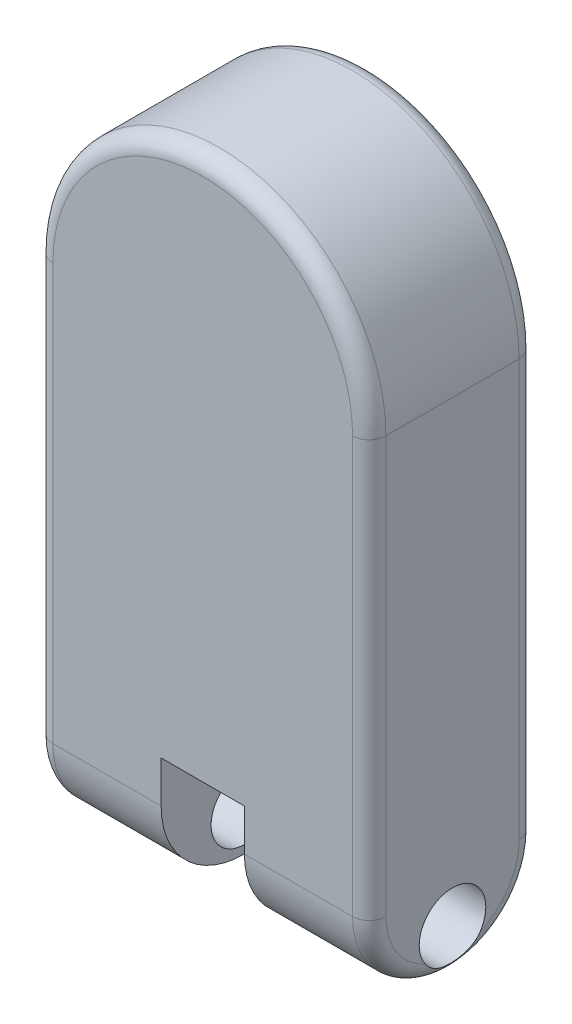
ISO-10303-21;
HEADER;
FILE_DESCRIPTION(('STEP AP214'),'2;1');
FILE_NAME('part.step','',(''),(''),'','','');
FILE_SCHEMA(('AUTOMOTIVE_DESIGN { 1 0 10303 214 1 1 1 1 }'));
ENDSEC;
DATA;
#1=APPLICATION_CONTEXT('core data for automotive mechanical design processes');
#2=APPLICATION_PROTOCOL_DEFINITION('international standard','automotive_design',2000,#1);
#3=PRODUCT_CONTEXT('',#1,'mechanical');
#4=PRODUCT('Part','Part','',(#3));
#5=PRODUCT_RELATED_PRODUCT_CATEGORY('part','',(#4));
#6=PRODUCT_DEFINITION_FORMATION('','',#4);
#7=PRODUCT_DEFINITION_CONTEXT('part definition',#1,'design');
#8=PRODUCT_DEFINITION('design','',#6,#7);
#9=PRODUCT_DEFINITION_SHAPE('','',#8);
#10=(LENGTH_UNIT() NAMED_UNIT(*) SI_UNIT(.MILLI.,.METRE.));
#11=(NAMED_UNIT(*) PLANE_ANGLE_UNIT() SI_UNIT($,.RADIAN.));
#12=(NAMED_UNIT(*) SI_UNIT($,.STERADIAN.) SOLID_ANGLE_UNIT());
#13=UNCERTAINTY_MEASURE_WITH_UNIT(LENGTH_MEASURE(1.E-05),#10,'distance_accuracy_value','');
#14=(GEOMETRIC_REPRESENTATION_CONTEXT(3) GLOBAL_UNCERTAINTY_ASSIGNED_CONTEXT((#13)) GLOBAL_UNIT_ASSIGNED_CONTEXT((#10,
#11,#12)) REPRESENTATION_CONTEXT('',''));
#15=CARTESIAN_POINT('',(0.,0.,0.));
#16=DIRECTION('',(0.,0.,1.));
#17=DIRECTION('',(1.,0.,0.));
#18=AXIS2_PLACEMENT_3D('',#15,#16,#17);
#19=CARTESIAN_POINT('',(-25.,-100.,-100.1));
#20=DIRECTION('',(0.,-1.,0.));
#21=DIRECTION('',(1.,0.,0.));
#22=AXIS2_PLACEMENT_3D('',#19,#20,#21);
#23=PLANE('',#22);
#24=DIRECTION('',(1.,0.,0.));
#25=VECTOR('',#24,1.);
#26=CARTESIAN_POINT('',(-25.,-100.,-100.));
#27=LINE('',#26,#25);
#28=CARTESIAN_POINT('',(-25.,-100.,-100.));
#29=VERTEX_POINT('',#28);
#30=CARTESIAN_POINT('',(25.,-100.,-100.));
#31=VERTEX_POINT('',#30);
#32=EDGE_CURVE('E92',#29,#31,#27,.T.);
#33=ORIENTED_EDGE('',*,*,#32,.T.);
#34=CARTESIAN_POINT('',(23.5893264020334,-100.,-90.1));
#35=DIRECTION('',(0.,-1.,0.));
#36=DIRECTION('',(1.,0.,0.));
#37=AXIS2_PLACEMENT_3D('',#34,#35,#36);
#38=CIRCLE('',#37,10.);
#39=CARTESIAN_POINT('',(23.5893264020334,-100.,-100.1));
#40=VERTEX_POINT('',#39);
#41=EDGE_CURVE('E12',#31,#40,#38,.F.);
#42=ORIENTED_EDGE('',*,*,#41,.T.);
#43=DIRECTION('',(1.,0.,0.));
#44=VECTOR('',#43,1.);
#45=CARTESIAN_POINT('',(-25.,-100.,-100.1));
#46=LINE('',#45,#44);
#47=CARTESIAN_POINT('',(-23.5893264020334,-100.,-100.1));
#48=VERTEX_POINT('',#47);
#49=EDGE_CURVE('E116',#48,#40,#46,.T.);
#50=ORIENTED_EDGE('',*,*,#49,.F.);
#51=CARTESIAN_POINT('',(-23.5893264020334,-100.,-90.1));
#52=DIRECTION('',(0.,-1.,0.));
#53=DIRECTION('',(1.,0.,0.));
#54=AXIS2_PLACEMENT_3D('',#51,#52,#53);
#55=CIRCLE('',#54,10.);
#56=EDGE_CURVE('E55',#48,#29,#55,.F.);
#57=ORIENTED_EDGE('',*,*,#56,.T.);
#58=EDGE_LOOP('',(#33,#42,#50,#57));
#59=FACE_BOUND('',#58,.T.);
#60=ADVANCED_FACE('F46',(#59),#23,.F.);
#61=CARTESIAN_POINT('',(0.,0.,-100.1));
#62=DIRECTION('',(0.,0.,-1.));
#63=DIRECTION('',(-1.,0.,0.));
#64=AXIS2_PLACEMENT_3D('',#61,#62,#63);
#65=PLANE('',#64);
#66=ORIENTED_EDGE('',*,*,#49,.T.);
#67=DIRECTION('',(0.,1.,0.));
#68=VECTOR('',#67,1.);
#69=CARTESIAN_POINT('',(23.5893264020334,-130.,-100.1));
#70=LINE('',#69,#68);
#71=CARTESIAN_POINT('',(23.5893264020334,-128.589326402033,-100.1));
#72=VERTEX_POINT('',#71);
#73=EDGE_CURVE('E104',#40,#72,#70,.F.);
#74=ORIENTED_EDGE('',*,*,#73,.T.);
#75=DIRECTION('',(1.,0.,0.));
#76=VECTOR('',#75,1.);
#77=CARTESIAN_POINT('',(-25.,-128.589326402033,-100.1));
#78=LINE('',#77,#76);
#79=CARTESIAN_POINT('',(-23.5893264020334,-128.589326402033,-100.1));
#80=VERTEX_POINT('',#79);
#81=EDGE_CURVE('E70',#72,#80,#78,.F.);
#82=ORIENTED_EDGE('',*,*,#81,.T.);
#83=DIRECTION('',(0.,-1.,0.));
#84=VECTOR('',#83,1.);
#85=CARTESIAN_POINT('',(-23.5893264020334,-100.,-100.1));
#86=LINE('',#85,#84);
#87=EDGE_CURVE('E107',#80,#48,#86,.F.);
#88=ORIENTED_EDGE('',*,*,#87,.T.);
#89=EDGE_LOOP('',(#66,#74,#82,#88));
#90=FACE_BOUND('',#89,.T.);
#91=ADVANCED_FACE('F120',(#90),#65,.T.);
#92=CARTESIAN_POINT('',(0.,0.,-100.));
#93=DIRECTION('',(0.,0.,-1.));
#94=DIRECTION('',(-1.,0.,0.));
#95=AXIS2_PLACEMENT_3D('',#92,#93,#94);
#96=PLANE('',#95);
#97=ORIENTED_EDGE('',*,*,#32,.F.);
#98=DIRECTION('',(0.,1.,0.));
#99=VECTOR('',#98,1.);
#100=CARTESIAN_POINT('',(-25.,-130.,-100.));
#101=LINE('',#100,#99);
#102=CARTESIAN_POINT('',(-25.,-130.,-100.));
#103=VERTEX_POINT('',#102);
#104=EDGE_CURVE('E115',#103,#29,#101,.T.);
#105=ORIENTED_EDGE('',*,*,#104,.F.);
#106=DIRECTION('',(-1.,0.,0.));
#107=VECTOR('',#106,1.);
#108=CARTESIAN_POINT('',(25.,-130.,-100.));
#109=LINE('',#108,#107);
#110=CARTESIAN_POINT('',(25.,-130.,-100.));
#111=VERTEX_POINT('',#110);
#112=EDGE_CURVE('E95',#111,#103,#109,.T.);
#113=ORIENTED_EDGE('',*,*,#112,.F.);
#114=DIRECTION('',(0.,-1.,0.));
#115=VECTOR('',#114,1.);
#116=CARTESIAN_POINT('',(25.,-100.,-100.));
#117=LINE('',#116,#115);
#118=EDGE_CURVE('E89',#31,#111,#117,.T.);
#119=ORIENTED_EDGE('',*,*,#118,.F.);
#120=EDGE_LOOP('',(#97,#105,#113,#119));
#121=FACE_BOUND('',#120,.T.);
#122=ADVANCED_FACE('F91',(#121),#96,.F.);
#123=CARTESIAN_POINT('',(-23.5893264020334,-130.,-90.1));
#124=DIRECTION('',(0.,1.,0.));
#125=DIRECTION('',(0.,0.,1.));
#126=AXIS2_PLACEMENT_3D('',#123,#124,#125);
#127=CYLINDRICAL_SURFACE('',#126,10.);
#128=ORIENTED_EDGE('',*,*,#56,.F.);
#129=ORIENTED_EDGE('',*,*,#87,.F.);
#130=CARTESIAN_POINT('',(-23.5893264020334,-128.589326402033,-90.1));
#131=DIRECTION('',(-0.707106781186547,0.707106781186547,0.));
#132=DIRECTION('',(0.707106781186547,0.707106781186547,0.));
#133=AXIS2_PLACEMENT_3D('',#130,#131,#132);
#134=ELLIPSE('',#133,14.1421356237309,10.);
#135=EDGE_CURVE('E50',#103,#80,#134,.F.);
#136=ORIENTED_EDGE('',*,*,#135,.F.);
#137=ORIENTED_EDGE('',*,*,#104,.T.);
#138=EDGE_LOOP('',(#128,#129,#136,#137));
#139=FACE_BOUND('',#138,.T.);
#140=ADVANCED_FACE('F48',(#139),#127,.T.);
#141=CARTESIAN_POINT('',(25.,-128.589326402033,-90.1));
#142=DIRECTION('',(-1.,0.,0.));
#143=DIRECTION('',(0.,0.,1.));
#144=AXIS2_PLACEMENT_3D('',#141,#142,#143);
#145=CYLINDRICAL_SURFACE('',#144,10.);
#146=ORIENTED_EDGE('',*,*,#135,.T.);
#147=ORIENTED_EDGE('',*,*,#81,.F.);
#148=CARTESIAN_POINT('',(23.5893264020334,-128.589326402033,-90.1));
#149=DIRECTION('',(-0.707106781186547,-0.707106781186548,0.));
#150=DIRECTION('',(-0.707106781186548,0.707106781186547,0.));
#151=AXIS2_PLACEMENT_3D('',#148,#149,#150);
#152=ELLIPSE('',#151,14.142135623731,10.);
#153=EDGE_CURVE('E63',#111,#72,#152,.F.);
#154=ORIENTED_EDGE('',*,*,#153,.F.);
#155=ORIENTED_EDGE('',*,*,#112,.T.);
#156=EDGE_LOOP('',(#146,#147,#154,#155));
#157=FACE_BOUND('',#156,.T.);
#158=ADVANCED_FACE('F113',(#157),#145,.T.);
#159=CARTESIAN_POINT('',(23.5893264020334,-100.,-90.1));
#160=DIRECTION('',(0.,-1.,0.));
#161=DIRECTION('',(1.,0.,0.));
#162=AXIS2_PLACEMENT_3D('',#159,#160,#161);
#163=CYLINDRICAL_SURFACE('',#162,10.);
#164=ORIENTED_EDGE('',*,*,#41,.F.);
#165=ORIENTED_EDGE('',*,*,#118,.T.);
#166=ORIENTED_EDGE('',*,*,#153,.T.);
#167=ORIENTED_EDGE('',*,*,#73,.F.);
#168=EDGE_LOOP('',(#164,#165,#166,#167));
#169=FACE_BOUND('',#168,.T.);
#170=ADVANCED_FACE('F103',(#169),#163,.T.);
#171=CLOSED_SHELL('',(#60,#91,#122,#140,#158,#170));
#172=MANIFOLD_SOLID_BREP('B2',#171);
#173=CARTESIAN_POINT('',(0.,-100.,-50.));
#174=DIRECTION('',(1.,0.,0.));
#175=DIRECTION('',(0.,0.,-1.));
#176=AXIS2_PLACEMENT_3D('',#173,#174,#175);
#177=CYLINDRICAL_SURFACE('',#176,50.);
#178=DIRECTION('',(1.,0.,0.));
#179=VECTOR('',#178,1.);
#180=CARTESIAN_POINT('',(0.,-100.,0.));
#181=LINE('',#180,#179);
#182=CARTESIAN_POINT('',(-90.,-100.,0.));
#183=VERTEX_POINT('',#182);
#184=CARTESIAN_POINT('',(-25.,-100.,0.));
#185=VERTEX_POINT('',#184);
#186=EDGE_CURVE('E367',#183,#185,#181,.T.);
#187=ORIENTED_EDGE('',*,*,#186,.F.);
#188=CARTESIAN_POINT('',(-90.,-100.,-50.));
#189=DIRECTION('',(-1.,0.,0.));
#190=DIRECTION('',(0.,-1.,0.));
#191=AXIS2_PLACEMENT_3D('',#188,#189,#190);
#192=CIRCLE('',#191,50.);
#193=CARTESIAN_POINT('',(-90.,-150.,-50.));
#194=VERTEX_POINT('',#193);
#195=EDGE_CURVE('E191',#183,#194,#192,.F.);
#196=ORIENTED_EDGE('',*,*,#195,.T.);
#197=DIRECTION('',(1.,0.,0.));
#198=VECTOR('',#197,1.);
#199=CARTESIAN_POINT('',(-100.,-150.,-50.));
#200=LINE('',#199,#198);
#201=CARTESIAN_POINT('',(-25.,-150.,-50.));
#202=VERTEX_POINT('',#201);
#203=EDGE_CURVE('E334',#202,#194,#200,.F.);
#204=ORIENTED_EDGE('',*,*,#203,.F.);
#205=CARTESIAN_POINT('',(-25.,-100.,-50.));
#206=DIRECTION('',(-1.,0.,0.));
#207=DIRECTION('',(0.,0.,1.));
#208=AXIS2_PLACEMENT_3D('',#205,#206,#207);
#209=CIRCLE('',#208,50.);
#210=EDGE_CURVE('E349',#185,#202,#209,.F.);
#211=ORIENTED_EDGE('',*,*,#210,.F.);
#212=EDGE_LOOP('',(#187,#196,#204,#211));
#213=FACE_BOUND('',#212,.T.);
#214=ADVANCED_FACE('F169',(#213),#177,.T.);
#215=CARTESIAN_POINT('',(-100.,-100.,-50.));
#216=DIRECTION('',(-1.,0.,0.));
#217=DIRECTION('',(0.,0.,1.));
#218=AXIS2_PLACEMENT_3D('',#215,#216,#217);
#219=CYLINDRICAL_SURFACE('',#218,50.);
#220=ORIENTED_EDGE('',*,*,#203,.T.);
#221=CARTESIAN_POINT('',(-90.,-100.,-50.));
#222=DIRECTION('',(-1.,0.,0.));
#223=DIRECTION('',(0.,-1.,0.));
#224=AXIS2_PLACEMENT_3D('',#221,#222,#223);
#225=CIRCLE('',#224,50.);
#226=CARTESIAN_POINT('',(-90.,-100.,-100.));
#227=VERTEX_POINT('',#226);
#228=EDGE_CURVE('E177',#194,#227,#225,.F.);
#229=ORIENTED_EDGE('',*,*,#228,.T.);
#230=DIRECTION('',(1.,0.,0.));
#231=VECTOR('',#230,1.);
#232=CARTESIAN_POINT('',(-100.,-100.,-100.));
#233=LINE('',#232,#231);
#234=CARTESIAN_POINT('',(-25.,-100.,-100.));
#235=VERTEX_POINT('',#234);
#236=EDGE_CURVE('E363',#235,#227,#233,.F.);
#237=ORIENTED_EDGE('',*,*,#236,.F.);
#238=CARTESIAN_POINT('',(-25.,-100.,-50.));
#239=DIRECTION('',(-1.,0.,0.));
#240=DIRECTION('',(0.,0.,1.));
#241=AXIS2_PLACEMENT_3D('',#238,#239,#240);
#242=CIRCLE('',#241,50.);
#243=EDGE_CURVE('E355',#202,#235,#242,.F.);
#244=ORIENTED_EDGE('',*,*,#243,.F.);
#245=EDGE_LOOP('',(#220,#229,#237,#244));
#246=FACE_BOUND('',#245,.T.);
#247=ADVANCED_FACE('F466',(#246),#219,.T.);
#248=CARTESIAN_POINT('',(100.,150.,-100.));
#249=DIRECTION('',(1.,0.,0.));
#250=DIRECTION('',(0.,1.,0.));
#251=AXIS2_PLACEMENT_3D('',#248,#249,#250);
#252=PLANE('',#251);
#253=CARTESIAN_POINT('',(100.,-100.,-50.));
#254=DIRECTION('',(1.,0.,0.));
#255=DIRECTION('',(0.,1.,0.));
#256=AXIS2_PLACEMENT_3D('',#253,#254,#255);
#257=CIRCLE('',#256,40.);
#258=CARTESIAN_POINT('',(100.,-136.5,-66.3630681719535));
#259=VERTEX_POINT('',#258);
#260=CARTESIAN_POINT('',(100.,-100.,-90.));
#261=VERTEX_POINT('',#260);
#262=EDGE_CURVE('E389',#259,#261,#257,.T.);
#263=ORIENTED_EDGE('',*,*,#262,.T.);
#264=DIRECTION('',(0.,1.,0.));
#265=VECTOR('',#264,1.);
#266=CARTESIAN_POINT('',(100.,150.,-90.));
#267=LINE('',#266,#265);
#268=CARTESIAN_POINT('',(100.,150.,-90.));
#269=VERTEX_POINT('',#268);
#270=EDGE_CURVE('E391',#261,#269,#267,.T.);
#271=ORIENTED_EDGE('',*,*,#270,.T.);
#272=DIRECTION('',(0.,0.,1.));
#273=VECTOR('',#272,1.);
#274=CARTESIAN_POINT('',(100.,150.,-100.));
#275=LINE('',#274,#273);
#276=CARTESIAN_POINT('',(100.,150.,-9.99999999999999));
#277=VERTEX_POINT('',#276);
#278=EDGE_CURVE('E345',#269,#277,#275,.T.);
#279=ORIENTED_EDGE('',*,*,#278,.T.);
#280=DIRECTION('',(0.,1.,0.));
#281=VECTOR('',#280,1.);
#282=CARTESIAN_POINT('',(100.,150.,-9.99999999999999));
#283=LINE('',#282,#281);
#284=CARTESIAN_POINT('',(100.,-100.,-10.));
#285=VERTEX_POINT('',#284);
#286=EDGE_CURVE('E385',#277,#285,#283,.F.);
#287=ORIENTED_EDGE('',*,*,#286,.T.);
#288=CARTESIAN_POINT('',(100.,-100.,-50.));
#289=DIRECTION('',(1.,0.,0.));
#290=DIRECTION('',(0.,1.,0.));
#291=AXIS2_PLACEMENT_3D('',#288,#289,#290);
#292=CIRCLE('',#291,40.);
#293=CARTESIAN_POINT('',(100.,-136.5,-33.6369318280465));
#294=VERTEX_POINT('',#293);
#295=EDGE_CURVE('E387',#285,#294,#292,.T.);
#296=ORIENTED_EDGE('',*,*,#295,.T.);
#297=CARTESIAN_POINT('',(100.,-125.,-50.));
#298=DIRECTION('',(-1.,0.,0.));
#299=DIRECTION('',(0.,-1.,0.));
#300=AXIS2_PLACEMENT_3D('',#297,#298,#299);
#301=CIRCLE('',#300,20.);
#302=EDGE_CURVE('E335',#294,#259,#301,.T.);
#303=ORIENTED_EDGE('',*,*,#302,.T.);
#304=EDGE_LOOP('',(#263,#271,#279,#287,#296,#303));
#305=FACE_BOUND('',#304,.T.);
#306=ADVANCED_FACE('F471',(#305),#252,.T.);
#307=CARTESIAN_POINT('',(-100.,150.,-100.));
#308=DIRECTION('',(-1.,0.,0.));
#309=DIRECTION('',(0.,-1.,0.));
#310=AXIS2_PLACEMENT_3D('',#307,#308,#309);
#311=PLANE('',#310);
#312=CARTESIAN_POINT('',(-100.,-100.,-50.));
#313=DIRECTION('',(-1.,0.,0.));
#314=DIRECTION('',(0.,-1.,0.));
#315=AXIS2_PLACEMENT_3D('',#312,#313,#314);
#316=CIRCLE('',#315,40.);
#317=CARTESIAN_POINT('',(-100.,-136.5,-33.6369318280464));
#318=VERTEX_POINT('',#317);
#319=CARTESIAN_POINT('',(-100.,-100.,-10.));
#320=VERTEX_POINT('',#319);
#321=EDGE_CURVE('E539',#318,#320,#316,.T.);
#322=ORIENTED_EDGE('',*,*,#321,.T.);
#323=DIRECTION('',(0.,-1.,0.));
#324=VECTOR('',#323,1.);
#325=CARTESIAN_POINT('',(-100.,150.,-9.99999999999999));
#326=LINE('',#325,#324);
#327=CARTESIAN_POINT('',(-100.,150.,-9.99999999999999));
#328=VERTEX_POINT('',#327);
#329=EDGE_CURVE('E437',#320,#328,#326,.F.);
#330=ORIENTED_EDGE('',*,*,#329,.T.);
#331=DIRECTION('',(0.,0.,1.));
#332=VECTOR('',#331,1.);
#333=CARTESIAN_POINT('',(-100.,150.,-100.));
#334=LINE('',#333,#332);
#335=CARTESIAN_POINT('',(-100.,150.,-90.));
#336=VERTEX_POINT('',#335);
#337=EDGE_CURVE('E346',#336,#328,#334,.T.);
#338=ORIENTED_EDGE('',*,*,#337,.F.);
#339=DIRECTION('',(0.,-1.,0.));
#340=VECTOR('',#339,1.);
#341=CARTESIAN_POINT('',(-100.,-100.,-90.));
#342=LINE('',#341,#340);
#343=CARTESIAN_POINT('',(-100.,-100.,-90.));
#344=VERTEX_POINT('',#343);
#345=EDGE_CURVE('E533',#336,#344,#342,.T.);
#346=ORIENTED_EDGE('',*,*,#345,.T.);
#347=CARTESIAN_POINT('',(-100.,-100.,-50.));
#348=DIRECTION('',(-1.,0.,0.));
#349=DIRECTION('',(0.,-1.,0.));
#350=AXIS2_PLACEMENT_3D('',#347,#348,#349);
#351=CIRCLE('',#350,40.);
#352=CARTESIAN_POINT('',(-100.,-136.5,-66.3630681719536));
#353=VERTEX_POINT('',#352);
#354=EDGE_CURVE('E538',#344,#353,#351,.T.);
#355=ORIENTED_EDGE('',*,*,#354,.T.);
#356=CARTESIAN_POINT('',(-100.,-125.,-50.));
#357=DIRECTION('',(-1.,0.,0.));
#358=DIRECTION('',(0.,-1.,0.));
#359=AXIS2_PLACEMENT_3D('',#356,#357,#358);
#360=CIRCLE('',#359,20.);
#361=EDGE_CURVE('E339',#318,#353,#360,.T.);
#362=ORIENTED_EDGE('',*,*,#361,.F.);
#363=EDGE_LOOP('',(#322,#330,#338,#346,#355,#362));
#364=FACE_BOUND('',#363,.T.);
#365=ADVANCED_FACE('F544',(#364),#311,.T.);
#366=CARTESIAN_POINT('',(0.,0.,-100.));
#367=DIRECTION('',(0.,0.,1.));
#368=DIRECTION('',(1.,0.,0.));
#369=AXIS2_PLACEMENT_3D('',#366,#367,#368);
#370=PLANE('',#369);
#371=CARTESIAN_POINT('',(0.,150.,-100.));
#372=DIRECTION('',(0.,0.,1.));
#373=DIRECTION('',(1.,0.,0.));
#374=AXIS2_PLACEMENT_3D('',#371,#372,#373);
#375=CIRCLE('',#374,90.);
#376=CARTESIAN_POINT('',(-90.,150.,-100.));
#377=VERTEX_POINT('',#376);
#378=CARTESIAN_POINT('',(90.,150.,-100.));
#379=VERTEX_POINT('',#378);
#380=EDGE_CURVE('E380',#377,#379,#375,.F.);
#381=ORIENTED_EDGE('',*,*,#380,.T.);
#382=DIRECTION('',(0.,1.,0.));
#383=VECTOR('',#382,1.);
#384=CARTESIAN_POINT('',(90.,-100.,-100.));
#385=LINE('',#384,#383);
#386=CARTESIAN_POINT('',(90.,-100.,-100.));
#387=VERTEX_POINT('',#386);
#388=EDGE_CURVE('E383',#379,#387,#385,.F.);
#389=ORIENTED_EDGE('',*,*,#388,.T.);
#390=CARTESIAN_POINT('',(25.,-100.,-100.));
#391=VERTEX_POINT('',#390);
#392=EDGE_CURVE('E368',#387,#391,#233,.F.);
#393=ORIENTED_EDGE('',*,*,#392,.T.);
#394=DIRECTION('',(-1.,0.,0.));
#395=VECTOR('',#394,1.);
#396=CARTESIAN_POINT('',(-25.,-100.,-100.));
#397=LINE('',#396,#395);
#398=EDGE_CURVE('E328',#391,#235,#397,.T.);
#399=ORIENTED_EDGE('',*,*,#398,.T.);
#400=ORIENTED_EDGE('',*,*,#236,.T.);
#401=DIRECTION('',(0.,-1.,0.));
#402=VECTOR('',#401,1.);
#403=CARTESIAN_POINT('',(-90.,150.,-100.));
#404=LINE('',#403,#402);
#405=EDGE_CURVE('E378',#227,#377,#404,.F.);
#406=ORIENTED_EDGE('',*,*,#405,.T.);
#407=EDGE_LOOP('',(#381,#389,#393,#399,#400,#406));
#408=FACE_BOUND('',#407,.T.);
#409=ADVANCED_FACE('F583',(#408),#370,.F.);
#410=CARTESIAN_POINT('',(0.,0.,0.));
#411=DIRECTION('',(0.,0.,1.));
#412=DIRECTION('',(1.,0.,0.));
#413=AXIS2_PLACEMENT_3D('',#410,#411,#412);
#414=PLANE('',#413);
#415=DIRECTION('',(0.,-1.,0.));
#416=VECTOR('',#415,1.);
#417=CARTESIAN_POINT('',(-25.,-100.,0.));
#418=LINE('',#417,#416);
#419=CARTESIAN_POINT('',(-25.,-75.,0.));
#420=VERTEX_POINT('',#419);
#421=EDGE_CURVE('E313',#420,#185,#418,.T.);
#422=ORIENTED_EDGE('',*,*,#421,.F.);
#423=DIRECTION('',(-1.,0.,0.));
#424=VECTOR('',#423,1.);
#425=CARTESIAN_POINT('',(-25.,-75.,0.));
#426=LINE('',#425,#424);
#427=CARTESIAN_POINT('',(25.,-75.,0.));
#428=VERTEX_POINT('',#427);
#429=EDGE_CURVE('E320',#428,#420,#426,.T.);
#430=ORIENTED_EDGE('',*,*,#429,.F.);
#431=DIRECTION('',(0.,1.,0.));
#432=VECTOR('',#431,1.);
#433=CARTESIAN_POINT('',(25.,-75.,0.));
#434=LINE('',#433,#432);
#435=CARTESIAN_POINT('',(25.,-100.,0.));
#436=VERTEX_POINT('',#435);
#437=EDGE_CURVE('E304',#436,#428,#434,.T.);
#438=ORIENTED_EDGE('',*,*,#437,.F.);
#439=CARTESIAN_POINT('',(90.,-100.,0.));
#440=VERTEX_POINT('',#439);
#441=EDGE_CURVE('E370',#436,#440,#181,.T.);
#442=ORIENTED_EDGE('',*,*,#441,.T.);
#443=DIRECTION('',(0.,1.,0.));
#444=VECTOR('',#443,1.);
#445=CARTESIAN_POINT('',(90.,0.,0.));
#446=LINE('',#445,#444);
#447=CARTESIAN_POINT('',(90.,150.,0.));
#448=VERTEX_POINT('',#447);
#449=EDGE_CURVE('E524',#440,#448,#446,.T.);
#450=ORIENTED_EDGE('',*,*,#449,.T.);
#451=CARTESIAN_POINT('',(0.,150.,0.));
#452=DIRECTION('',(0.,0.,1.));
#453=DIRECTION('',(1.,0.,0.));
#454=AXIS2_PLACEMENT_3D('',#451,#452,#453);
#455=CIRCLE('',#454,90.);
#456=CARTESIAN_POINT('',(-90.,150.,0.));
#457=VERTEX_POINT('',#456);
#458=EDGE_CURVE('E529',#448,#457,#455,.T.);
#459=ORIENTED_EDGE('',*,*,#458,.T.);
#460=DIRECTION('',(0.,-1.,0.));
#461=VECTOR('',#460,1.);
#462=CARTESIAN_POINT('',(-90.,0.,0.));
#463=LINE('',#462,#461);
#464=EDGE_CURVE('E498',#457,#183,#463,.T.);
#465=ORIENTED_EDGE('',*,*,#464,.T.);
#466=ORIENTED_EDGE('',*,*,#186,.T.);
#467=EDGE_LOOP('',(#422,#430,#438,#442,#450,#459,#465,#466));
#468=FACE_BOUND('',#467,.T.);
#469=ADVANCED_FACE('F593',(#468),#414,.T.);
#470=CARTESIAN_POINT('',(25.,-175.,-100.));
#471=DIRECTION('',(1.,0.,0.));
#472=DIRECTION('',(0.,0.,-1.));
#473=AXIS2_PLACEMENT_3D('',#470,#471,#472);
#474=PLANE('',#473);
#475=CARTESIAN_POINT('',(25.,-100.,-50.));
#476=DIRECTION('',(1.,0.,0.));
#477=DIRECTION('',(0.,0.,-1.));
#478=AXIS2_PLACEMENT_3D('',#475,#476,#477);
#479=CIRCLE('',#478,50.);
#480=CARTESIAN_POINT('',(25.,-150.,-50.));
#481=VERTEX_POINT('',#480);
#482=EDGE_CURVE('E358',#481,#436,#479,.F.);
#483=ORIENTED_EDGE('',*,*,#482,.T.);
#484=ORIENTED_EDGE('',*,*,#437,.T.);
#485=DIRECTION('',(0.,0.,1.));
#486=VECTOR('',#485,1.);
#487=CARTESIAN_POINT('',(25.,-75.,-99.));
#488=LINE('',#487,#486);
#489=CARTESIAN_POINT('',(25.,-75.,-99.));
#490=VERTEX_POINT('',#489);
#491=EDGE_CURVE('E296',#490,#428,#488,.T.);
#492=ORIENTED_EDGE('',*,*,#491,.F.);
#493=DIRECTION('',(0.,1.,0.));
#494=VECTOR('',#493,1.);
#495=CARTESIAN_POINT('',(25.,-75.,-99.));
#496=LINE('',#495,#494);
#497=CARTESIAN_POINT('',(25.,-99.4302970896538,-99.));
#498=VERTEX_POINT('',#497);
#499=EDGE_CURVE('E302',#498,#490,#496,.T.);
#500=ORIENTED_EDGE('',*,*,#499,.F.);
#501=CARTESIAN_POINT('',(25.,-186.602540378444,-50.));
#502=DIRECTION('',(1.,0.,0.));
#503=DIRECTION('',(0.,0.,-1.));
#504=AXIS2_PLACEMENT_3D('',#501,#502,#503);
#505=CIRCLE('',#504,100.);
#506=EDGE_CURVE('E329',#391,#498,#505,.T.);
#507=ORIENTED_EDGE('',*,*,#506,.F.);
#508=CARTESIAN_POINT('',(25.,-100.,-50.));
#509=DIRECTION('',(1.,0.,0.));
#510=DIRECTION('',(0.,0.,-1.));
#511=AXIS2_PLACEMENT_3D('',#508,#509,#510);
#512=CIRCLE('',#511,50.);
#513=EDGE_CURVE('E360',#391,#481,#512,.F.);
#514=ORIENTED_EDGE('',*,*,#513,.T.);
#515=EDGE_LOOP('',(#483,#484,#492,#500,#507,#514));
#516=FACE_BOUND('',#515,.T.);
#517=CARTESIAN_POINT('',(25.,-125.,-50.));
#518=DIRECTION('',(1.,0.,0.));
#519=DIRECTION('',(0.,0.,-1.));
#520=AXIS2_PLACEMENT_3D('',#517,#518,#519);
#521=CIRCLE('',#520,20.);
#522=CARTESIAN_POINT('',(25.,-125.,-70.));
#523=VERTEX_POINT('',#522);
#524=EDGE_CURVE('E342',#523,#523,#521,.T.);
#525=ORIENTED_EDGE('',*,*,#524,.T.);
#526=EDGE_LOOP('',(#525));
#527=FACE_BOUND('',#526,.T.);
#528=ADVANCED_FACE('F299',(#516,#527),#474,.F.);
#529=CARTESIAN_POINT('',(-25.,-175.,-100.));
#530=DIRECTION('',(-1.,0.,0.));
#531=DIRECTION('',(0.,0.,1.));
#532=AXIS2_PLACEMENT_3D('',#529,#530,#531);
#533=PLANE('',#532);
#534=ORIENTED_EDGE('',*,*,#421,.T.);
#535=ORIENTED_EDGE('',*,*,#210,.T.);
#536=ORIENTED_EDGE('',*,*,#243,.T.);
#537=CARTESIAN_POINT('',(-25.,-186.602540378444,-50.));
#538=DIRECTION('',(1.,0.,0.));
#539=DIRECTION('',(0.,0.,-1.));
#540=AXIS2_PLACEMENT_3D('',#537,#538,#539);
#541=CIRCLE('',#540,100.);
#542=CARTESIAN_POINT('',(-25.,-99.4302970896538,-99.));
#543=VERTEX_POINT('',#542);
#544=EDGE_CURVE('E325',#235,#543,#541,.T.);
#545=ORIENTED_EDGE('',*,*,#544,.T.);
#546=DIRECTION('',(0.,-1.,0.));
#547=VECTOR('',#546,1.);
#548=CARTESIAN_POINT('',(-25.,-100.,-99.));
#549=LINE('',#548,#547);
#550=CARTESIAN_POINT('',(-25.,-75.,-99.));
#551=VERTEX_POINT('',#550);
#552=EDGE_CURVE('E184',#551,#543,#549,.T.);
#553=ORIENTED_EDGE('',*,*,#552,.F.);
#554=DIRECTION('',(0.,0.,1.));
#555=VECTOR('',#554,1.);
#556=CARTESIAN_POINT('',(-25.,-75.,-99.));
#557=LINE('',#556,#555);
#558=EDGE_CURVE('E309',#551,#420,#557,.T.);
#559=ORIENTED_EDGE('',*,*,#558,.T.);
#560=EDGE_LOOP('',(#534,#535,#536,#545,#553,#559));
#561=FACE_BOUND('',#560,.T.);
#562=CARTESIAN_POINT('',(-25.,-125.,-50.));
#563=DIRECTION('',(-1.,0.,0.));
#564=DIRECTION('',(0.,0.,1.));
#565=AXIS2_PLACEMENT_3D('',#562,#563,#564);
#566=CIRCLE('',#565,20.);
#567=CARTESIAN_POINT('',(-25.,-125.,-30.));
#568=VERTEX_POINT('',#567);
#569=EDGE_CURVE('E338',#568,#568,#566,.T.);
#570=ORIENTED_EDGE('',*,*,#569,.T.);
#571=EDGE_LOOP('',(#570));
#572=FACE_BOUND('',#571,.T.);
#573=ADVANCED_FACE('F422',(#561,#572),#533,.F.);
#574=CARTESIAN_POINT('',(100.,-125.,-50.));
#575=DIRECTION('',(-1.,0.,0.));
#576=DIRECTION('',(0.,-1.,0.));
#577=AXIS2_PLACEMENT_3D('',#574,#575,#576);
#578=CYLINDRICAL_SURFACE('',#577,20.);
#579=CARTESIAN_POINT('',(-100.,-136.5,-66.3630681719536));
#580=CARTESIAN_POINT('',(-99.9999944988369,-136.717635786294,-66.2101150233157));
#581=CARTESIAN_POINT('',(-99.9972251505422,-136.932182024762,-66.0528421805291));
#582=CARTESIAN_POINT('',(-99.9867556613727,-137.35473388776,-65.729947430497));
#583=CARTESIAN_POINT('',(-99.9790561221654,-137.562740307143,-65.5643265442968));
#584=CARTESIAN_POINT('',(-99.9494718778201,-138.176161814739,-65.0555886797701));
#585=CARTESIAN_POINT('',(-99.9210996400918,-138.571325329766,-64.7003530754295));
#586=CARTESIAN_POINT('',(-99.8515096756831,-139.330811895632,-63.9609577577295));
#587=CARTESIAN_POINT('',(-99.8103152955771,-139.695189480587,-63.5768515684689));
#588=CARTESIAN_POINT('',(-99.7190573029856,-140.391950208584,-62.7815251896323));
#589=CARTESIAN_POINT('',(-99.6689923089183,-140.724328355308,-62.3703007827167));
#590=CARTESIAN_POINT('',(-99.5631593930954,-141.358618976357,-61.5187034560061));
#591=CARTESIAN_POINT('',(-99.5073357106278,-141.660163582177,-61.0780636594513));
#592=CARTESIAN_POINT('',(-99.3940622995594,-142.226993438192,-60.1742441935076));
#593=CARTESIAN_POINT('',(-99.3366125479803,-142.492278175682,-59.7110642055318));
#594=CARTESIAN_POINT('',(-99.2235017558159,-142.985054029716,-58.7648363026766));
#595=CARTESIAN_POINT('',(-99.167840615512,-143.212547256171,-58.2817894988467));
#596=CARTESIAN_POINT('',(-99.0614849028067,-143.628363325728,-57.2985605452276));
#597=CARTESIAN_POINT('',(-99.0107905215469,-143.816684661646,-56.7983777369726));
#598=CARTESIAN_POINT('',(-98.914628020795,-144.162335252227,-55.7553050669511));
#599=CARTESIAN_POINT('',(-98.8696146444547,-144.31732359583,-55.2115959974651));
#600=CARTESIAN_POINT('',(-98.7912772213222,-144.580856141992,-54.1121164115952));
#601=CARTESIAN_POINT('',(-98.7579530630838,-144.689400787352,-53.556346010259));
#602=CARTESIAN_POINT('',(-98.7183397843355,-144.816752364834,-52.7160701639445));
#603=CARTESIAN_POINT('',(-98.7068534918599,-144.853323941299,-52.4343883277259));
#604=CARTESIAN_POINT('',(-98.6875556329067,-144.914450380322,-51.8695779250219));
#605=CARTESIAN_POINT('',(-98.6797440577708,-144.939005271195,-51.5864493619469));
#606=CARTESIAN_POINT('',(-98.6679366207012,-144.976034163262,-51.0192418997107));
#607=CARTESIAN_POINT('',(-98.6639419207102,-144.988504485659,-50.7351627375596));
#608=CARTESIAN_POINT('',(-98.6598264732936,-145.001327339773,-50.1666967726028));
#609=CARTESIAN_POINT('',(-98.6597058137055,-145.001679596733,-49.8823099629679));
#610=CARTESIAN_POINT('',(-98.6615493262836,-144.995960582491,-49.5980542531013));
#611=B_SPLINE_CURVE_WITH_KNOTS('',3,(#579,#580,#581,#582,#583,#584,#585,#586,#587,#588,#589,
#590,#591,#592,#593,#594,#595,#596,#597,#598,#599,#600,#601,#602,#603,#604,#605,#606,#607,#608,
#609,#610),.UNSPECIFIED.,.F.,.F.,(4,2,2,2,2,2,2,2,2,2,2,2,2,2,2,4),(0.,0.797874642750557,
1.59565193352407,3.1899412608992,4.78134451960049,6.37299585463967,7.9818400114366,
9.59070691451072,11.1994839638915,12.8083229014096,14.5077128583875,16.2070866127463,
17.0596892460926,17.91228987052,18.7651499631725,19.6180293930039),.UNSPECIFIED.);
#612=CARTESIAN_POINT('',(-98.6602540378444,-145.,-50.));
#613=VERTEX_POINT('',#612);
#614=EDGE_CURVE('E429',#353,#613,#611,.T.);
#615=ORIENTED_EDGE('',*,*,#614,.T.);
#616=CARTESIAN_POINT('',(-98.6602540378444,-145.,-50.));
#617=CARTESIAN_POINT('',(-98.660247528865,-145.000000557423,-49.7291162562174));
#618=CARTESIAN_POINT('',(-98.6620203059655,-144.994495715576,-49.4582663052626));
#619=CARTESIAN_POINT('',(-98.6690632302412,-144.972496289671,-48.9170644816353));
#620=CARTESIAN_POINT('',(-98.6743333002116,-144.956001948214,-48.6467125980998));
#621=CARTESIAN_POINT('',(-98.6952902819852,-144.8900894424,-47.8373209986366));
#622=CARTESIAN_POINT('',(-98.7161240917141,-144.824241746037,-47.2996541799823));
#623=CARTESIAN_POINT('',(-98.7701739357349,-144.649543192614,-46.2334838396406));
#624=CARTESIAN_POINT('',(-98.8033583037589,-144.540802269524,-45.7049604702912));
#625=CARTESIAN_POINT('',(-98.8801161670473,-144.281208901752,-44.6590938773701));
#626=CARTESIAN_POINT('',(-98.9236903013259,-144.130353866779,-44.1417513436021));
#627=CARTESIAN_POINT('',(-99.0189152913429,-143.786789461718,-43.1189296044383));
#628=CARTESIAN_POINT('',(-99.0706068716683,-143.593867036125,-42.6135258599768));
#629=CARTESIAN_POINT('',(-99.1788835403941,-143.16796707267,-41.6204488654864));
#630=CARTESIAN_POINT('',(-99.2354685830894,-142.934989908899,-41.1327754499163));
#631=CARTESIAN_POINT('',(-99.3502215235499,-142.430402873405,-40.1779497284365));
#632=CARTESIAN_POINT('',(-99.4083896442132,-142.158787538414,-39.7108003367798));
#633=CARTESIAN_POINT('',(-99.5227473765823,-141.578517537487,-38.7998012021265));
#634=CARTESIAN_POINT('',(-99.5789368427548,-141.269860154377,-38.3559531718098));
#635=CARTESIAN_POINT('',(-99.6878982994192,-140.602912464245,-37.4753289636808));
#636=CARTESIAN_POINT('',(-99.740412180585,-140.243038677624,-37.0397174887075));
#637=CARTESIAN_POINT('',(-99.8345685865417,-139.487138492257,-36.1999281519389));
#638=CARTESIAN_POINT('',(-99.8762127470128,-139.09111754507,-35.7957455671454));
#639=CARTESIAN_POINT('',(-99.9437724111679,-138.26432007541,-35.0206968408248));
#640=CARTESIAN_POINT('',(-99.969646571122,-137.833455521703,-34.6499204268788));
#641=CARTESIAN_POINT('',(-99.992406932906,-137.164262783443,-34.1219764911394));
#642=CARTESIAN_POINT('',(-99.997317042392,-136.937265917523,-33.9506217314705));
#643=CARTESIAN_POINT('',(-100.001019493978,-136.47611190923,-33.6177002554482));
#644=CARTESIAN_POINT('',(-99.9998109947271,-136.241953786537,-33.4561348882949));
#645=CARTESIAN_POINT('',(-99.9951651075579,-136.004453188326,-33.299640422256));
#646=B_SPLINE_CURVE_WITH_KNOTS('',3,(#616,#617,#618,#619,#620,#621,#622,#623,#624,#625,#626,
#627,#628,#629,#630,#631,#632,#633,#634,#635,#636,#637,#638,#639,#640,#641,#642,#643,#644,#645),
.UNSPECIFIED.,.F.,.F.,(4,2,2,2,2,2,2,2,2,2,2,2,2,2,4),(0.,0.812522437824897,1.62502693931456,
3.24916534614429,4.8691679062604,6.48927012904759,8.1177764581638,9.74626757863838,
11.3749891898565,13.0038303470725,14.704137296452,16.404188235224,18.1086771866606,
18.9617565600298,19.8149532408673),.UNSPECIFIED.);
#647=EDGE_CURVE('E436',#613,#318,#646,.T.);
#648=ORIENTED_EDGE('',*,*,#647,.T.);
#649=ORIENTED_EDGE('',*,*,#361,.T.);
#650=EDGE_LOOP('',(#615,#648,#649));
#651=FACE_BOUND('',#650,.T.);
#652=ORIENTED_EDGE('',*,*,#569,.F.);
#653=EDGE_LOOP('',(#652));
#654=FACE_BOUND('',#653,.T.);
#655=ADVANCED_FACE('F418',(#651,#654),#578,.F.);
#656=CARTESIAN_POINT('',(100.,-136.5,-33.6369318280465));
#657=CARTESIAN_POINT('',(99.9999944988369,-136.717635786294,-33.7898849766843));
#658=CARTESIAN_POINT('',(99.9972251505423,-136.932182024762,-33.9471578194709));
#659=CARTESIAN_POINT('',(99.9867556613727,-137.35473388776,-34.270052569503));
#660=CARTESIAN_POINT('',(99.9790561221654,-137.562740307143,-34.4356734557032));
#661=CARTESIAN_POINT('',(99.9494718778202,-138.176161814739,-34.9444113202299));
#662=CARTESIAN_POINT('',(99.9210996400919,-138.571325329766,-35.2996469245705));
#663=CARTESIAN_POINT('',(99.8515096756831,-139.330811895632,-36.0390422422705));
#664=CARTESIAN_POINT('',(99.8103152955772,-139.695189480587,-36.4231484315311));
#665=CARTESIAN_POINT('',(99.7190573029856,-140.391950208584,-37.2184748103677));
#666=CARTESIAN_POINT('',(99.6689923089184,-140.724328355308,-37.6296992172834));
#667=CARTESIAN_POINT('',(99.5631593930955,-141.358618976357,-38.481296543994));
#668=CARTESIAN_POINT('',(99.5073357106278,-141.660163582177,-38.9219363405488));
#669=CARTESIAN_POINT('',(99.3940622995595,-142.226993438192,-39.8257558064925));
#670=CARTESIAN_POINT('',(99.3366125479804,-142.492278175682,-40.2889357944682));
#671=CARTESIAN_POINT('',(99.223501755816,-142.985054029716,-41.2351636973234));
#672=CARTESIAN_POINT('',(99.1678406155121,-143.212547256171,-41.7182105011533));
#673=CARTESIAN_POINT('',(99.0614849028068,-143.628363325728,-42.7014394547724));
#674=CARTESIAN_POINT('',(99.010790521547,-143.816684661646,-43.2016222630274));
#675=CARTESIAN_POINT('',(98.914628020795,-144.162335252227,-44.2446949330489));
#676=CARTESIAN_POINT('',(98.8696146444547,-144.31732359583,-44.7884040025349));
#677=CARTESIAN_POINT('',(98.7912772213223,-144.580856141992,-45.8878835884048));
#678=CARTESIAN_POINT('',(98.7579530630839,-144.689400787352,-46.443653989741));
#679=CARTESIAN_POINT('',(98.7183397843356,-144.816752364834,-47.2839298360555));
#680=CARTESIAN_POINT('',(98.7068534918599,-144.853323941299,-47.5656116722741));
#681=CARTESIAN_POINT('',(98.6875556329068,-144.914450380322,-48.1304220749781));
#682=CARTESIAN_POINT('',(98.6797440577709,-144.939005271195,-48.4135506380531));
#683=CARTESIAN_POINT('',(98.6679366207012,-144.976034163262,-48.9807581002893));
#684=CARTESIAN_POINT('',(98.6639419207103,-144.988504485659,-49.2648372624404));
#685=CARTESIAN_POINT('',(98.6598264732937,-145.001327339773,-49.8333032273972));
#686=CARTESIAN_POINT('',(98.6597058137055,-145.001679596733,-50.1176900370321));
#687=CARTESIAN_POINT('',(98.6615493262836,-144.995960582491,-50.4019457468987));
#688=B_SPLINE_CURVE_WITH_KNOTS('',3,(#656,#657,#658,#659,#660,#661,#662,#663,#664,#665,#666,
#667,#668,#669,#670,#671,#672,#673,#674,#675,#676,#677,#678,#679,#680,#681,#682,#683,#684,#685,
#686,#687),.UNSPECIFIED.,.F.,.F.,(4,2,2,2,2,2,2,2,2,2,2,2,2,2,2,4),(0.,0.797874642750553,
1.59565193352409,3.1899412608992,4.78134451960052,6.37299585463969,7.98184001143664,
9.59070691451072,11.1994839638915,12.8083229014095,14.5077128583875,16.2070866127463,
17.0596892460926,17.91228987052,18.7651499631725,19.6180293930039),.UNSPECIFIED.);
#689=CARTESIAN_POINT('',(98.6602540378445,-145.,-50.));
#690=VERTEX_POINT('',#689);
#691=EDGE_CURVE('E393',#294,#690,#688,.T.);
#692=ORIENTED_EDGE('',*,*,#691,.T.);
#693=CARTESIAN_POINT('',(98.6602540378444,-145.,-50.));
#694=CARTESIAN_POINT('',(98.6602475288651,-145.000000557423,-50.2708837437826));
#695=CARTESIAN_POINT('',(98.6620203059656,-144.994495715576,-50.5417336947374));
#696=CARTESIAN_POINT('',(98.6690632302413,-144.972496289671,-51.0829355183647));
#697=CARTESIAN_POINT('',(98.6743333002116,-144.956001948214,-51.3532874019002));
#698=CARTESIAN_POINT('',(98.6952902819853,-144.8900894424,-52.1626790013634));
#699=CARTESIAN_POINT('',(98.7161240917141,-144.824241746037,-52.7003458200177));
#700=CARTESIAN_POINT('',(98.7701739357349,-144.649543192614,-53.7665161603594));
#701=CARTESIAN_POINT('',(98.8033583037589,-144.540802269524,-54.2950395297088));
#702=CARTESIAN_POINT('',(98.8801161670473,-144.281208901752,-55.3409061226299));
#703=CARTESIAN_POINT('',(98.923690301326,-144.130353866779,-55.858248656398));
#704=CARTESIAN_POINT('',(99.0189152913429,-143.786789461718,-56.8810703955617));
#705=CARTESIAN_POINT('',(99.0706068716684,-143.593867036125,-57.3864741400232));
#706=CARTESIAN_POINT('',(99.1788835403941,-143.16796707267,-58.3795511345136));
#707=CARTESIAN_POINT('',(99.2354685830894,-142.934989908899,-58.8672245500837));
#708=CARTESIAN_POINT('',(99.35022152355,-142.430402873405,-59.8220502715635));
#709=CARTESIAN_POINT('',(99.4083896442133,-142.158787538414,-60.2891996632202));
#710=CARTESIAN_POINT('',(99.5227473765824,-141.578517537487,-61.2001987978735));
#711=CARTESIAN_POINT('',(99.5789368427548,-141.269860154377,-61.6440468281902));
#712=CARTESIAN_POINT('',(99.6878982994192,-140.602912464245,-62.5246710363192));
#713=CARTESIAN_POINT('',(99.740412180585,-140.243038677624,-62.9602825112925));
#714=CARTESIAN_POINT('',(99.8345685865418,-139.487138492257,-63.8000718480611));
#715=CARTESIAN_POINT('',(99.8762127470129,-139.09111754507,-64.2042544328546));
#716=CARTESIAN_POINT('',(99.943772411168,-138.26432007541,-64.9793031591752));
#717=CARTESIAN_POINT('',(99.969646571122,-137.833455521703,-65.3500795731212));
#718=CARTESIAN_POINT('',(99.992406932906,-137.164262783443,-65.8780235088606));
#719=CARTESIAN_POINT('',(99.9973170423921,-136.937265917523,-66.0493782685295));
#720=CARTESIAN_POINT('',(100.001019493978,-136.47611190923,-66.3822997445518));
#721=CARTESIAN_POINT('',(99.9998109947272,-136.241953786537,-66.5438651117052));
#722=CARTESIAN_POINT('',(99.995165107558,-136.004453188326,-66.700359577744));
#723=B_SPLINE_CURVE_WITH_KNOTS('',3,(#693,#694,#695,#696,#697,#698,#699,#700,#701,#702,#703,
#704,#705,#706,#707,#708,#709,#710,#711,#712,#713,#714,#715,#716,#717,#718,#719,#720,#721,#722),
.UNSPECIFIED.,.F.,.F.,(4,2,2,2,2,2,2,2,2,2,2,2,2,2,4),(0.,0.812522437824897,1.62502693931456,
3.2491653461443,4.86916790626038,6.4892701290476,8.1177764581638,9.74626757863837,
11.3749891898565,13.0038303470725,14.704137296452,16.404188235224,18.1086771866605,
18.9617565600298,19.8149532408673),.UNSPECIFIED.);
#724=EDGE_CURVE('E401',#690,#259,#723,.T.);
#725=ORIENTED_EDGE('',*,*,#724,.T.);
#726=ORIENTED_EDGE('',*,*,#302,.F.);
#727=EDGE_LOOP('',(#692,#725,#726));
#728=FACE_BOUND('',#727,.T.);
#729=ORIENTED_EDGE('',*,*,#524,.F.);
#730=EDGE_LOOP('',(#729));
#731=FACE_BOUND('',#730,.T.);
#732=ADVANCED_FACE('F412',(#728,#731),#578,.F.);
#733=DIRECTION('',(1.,0.,0.));
#734=VECTOR('',#733,1.);
#735=CARTESIAN_POINT('',(62.5,-150.,-50.));
#736=LINE('',#735,#734);
#737=CARTESIAN_POINT('',(90.,-150.,-50.));
#738=VERTEX_POINT('',#737);
#739=EDGE_CURVE('E364',#738,#481,#736,.F.);
#740=ORIENTED_EDGE('',*,*,#739,.F.);
#741=CARTESIAN_POINT('',(90.,-100.,-50.));
#742=DIRECTION('',(1.,0.,0.));
#743=DIRECTION('',(0.,1.,0.));
#744=AXIS2_PLACEMENT_3D('',#741,#742,#743);
#745=CIRCLE('',#744,50.);
#746=EDGE_CURVE('E486',#738,#440,#745,.F.);
#747=ORIENTED_EDGE('',*,*,#746,.T.);
#748=ORIENTED_EDGE('',*,*,#441,.F.);
#749=ORIENTED_EDGE('',*,*,#482,.F.);
#750=EDGE_LOOP('',(#740,#747,#748,#749));
#751=FACE_BOUND('',#750,.T.);
#752=ADVANCED_FACE('F417',(#751),#177,.T.);
#753=ORIENTED_EDGE('',*,*,#392,.F.);
#754=CARTESIAN_POINT('',(90.,-100.,-50.));
#755=DIRECTION('',(1.,0.,0.));
#756=DIRECTION('',(0.,1.,0.));
#757=AXIS2_PLACEMENT_3D('',#754,#755,#756);
#758=CIRCLE('',#757,50.);
#759=EDGE_CURVE('E499',#387,#738,#758,.F.);
#760=ORIENTED_EDGE('',*,*,#759,.T.);
#761=ORIENTED_EDGE('',*,*,#739,.T.);
#762=ORIENTED_EDGE('',*,*,#513,.F.);
#763=EDGE_LOOP('',(#753,#760,#761,#762));
#764=FACE_BOUND('',#763,.T.);
#765=ADVANCED_FACE('F474',(#764),#219,.T.);
#766=CARTESIAN_POINT('',(-25.,-186.602540378444,-50.));
#767=DIRECTION('',(1.,0.,0.));
#768=DIRECTION('',(0.,0.,-1.));
#769=AXIS2_PLACEMENT_3D('',#766,#767,#768);
#770=CYLINDRICAL_SURFACE('',#769,100.);
#771=ORIENTED_EDGE('',*,*,#506,.T.);
#772=DIRECTION('',(1.,0.,0.));
#773=VECTOR('',#772,1.);
#774=CARTESIAN_POINT('',(-25.,-99.4302970896538,-99.));
#775=LINE('',#774,#773);
#776=EDGE_CURVE('E44',#498,#543,#775,.F.);
#777=ORIENTED_EDGE('',*,*,#776,.T.);
#778=ORIENTED_EDGE('',*,*,#544,.F.);
#779=ORIENTED_EDGE('',*,*,#398,.F.);
#780=EDGE_LOOP('',(#771,#777,#778,#779));
#781=FACE_BOUND('',#780,.T.);
#782=ADVANCED_FACE('F420',(#781),#770,.F.);
#783=CARTESIAN_POINT('',(0.,150.,-100.));
#784=DIRECTION('',(0.,0.,1.));
#785=DIRECTION('',(1.,0.,0.));
#786=AXIS2_PLACEMENT_3D('',#783,#784,#785);
#787=CYLINDRICAL_SURFACE('',#786,100.);
#788=ORIENTED_EDGE('',*,*,#278,.F.);
#789=CARTESIAN_POINT('',(0.,150.,-90.));
#790=DIRECTION('',(0.,0.,1.));
#791=DIRECTION('',(1.,0.,0.));
#792=AXIS2_PLACEMENT_3D('',#789,#790,#791);
#793=CIRCLE('',#792,100.);
#794=EDGE_CURVE('E375',#269,#336,#793,.T.);
#795=ORIENTED_EDGE('',*,*,#794,.T.);
#796=ORIENTED_EDGE('',*,*,#337,.T.);
#797=CARTESIAN_POINT('',(0.,150.,-9.99999999999999));
#798=DIRECTION('',(0.,0.,1.));
#799=DIRECTION('',(1.,0.,0.));
#800=AXIS2_PLACEMENT_3D('',#797,#798,#799);
#801=CIRCLE('',#800,100.);
#802=EDGE_CURVE('E366',#328,#277,#801,.F.);
#803=ORIENTED_EDGE('',*,*,#802,.T.);
#804=EDGE_LOOP('',(#788,#795,#796,#803));
#805=FACE_BOUND('',#804,.T.);
#806=ADVANCED_FACE('F549',(#805),#787,.T.);
#807=CARTESIAN_POINT('',(0.,150.,-9.99999999999999));
#808=DIRECTION('',(0.,0.,1.));
#809=DIRECTION('',(1.,0.,0.));
#810=AXIS2_PLACEMENT_3D('',#807,#808,#809);
#811=TOROIDAL_SURFACE('',#810,90.,10.);
#812=CARTESIAN_POINT('',(-90.,150.,-10.));
#813=DIRECTION('',(0.,-1.,0.));
#814=DIRECTION('',(0.,0.,-1.));
#815=AXIS2_PLACEMENT_3D('',#812,#813,#814);
#816=CIRCLE('',#815,10.);
#817=EDGE_CURVE('E516',#457,#328,#816,.T.);
#818=ORIENTED_EDGE('',*,*,#817,.F.);
#819=ORIENTED_EDGE('',*,*,#458,.F.);
#820=CARTESIAN_POINT('',(90.,150.,-9.99999999999999));
#821=DIRECTION('',(0.,-1.,0.));
#822=DIRECTION('',(0.,0.,-1.));
#823=AXIS2_PLACEMENT_3D('',#820,#821,#822);
#824=CIRCLE('',#823,10.);
#825=EDGE_CURVE('E331',#277,#448,#824,.T.);
#826=ORIENTED_EDGE('',*,*,#825,.F.);
#827=ORIENTED_EDGE('',*,*,#802,.F.);
#828=EDGE_LOOP('',(#818,#819,#826,#827));
#829=FACE_BOUND('',#828,.T.);
#830=ADVANCED_FACE('F171',(#829),#811,.T.);
#831=CARTESIAN_POINT('',(90.,0.,-10.));
#832=DIRECTION('',(0.,1.,0.));
#833=DIRECTION('',(-1.,0.,0.));
#834=AXIS2_PLACEMENT_3D('',#831,#832,#833);
#835=CYLINDRICAL_SURFACE('',#834,10.);
#836=ORIENTED_EDGE('',*,*,#825,.T.);
#837=ORIENTED_EDGE('',*,*,#449,.F.);
#838=CARTESIAN_POINT('',(90.,-100.,-10.));
#839=DIRECTION('',(0.,-1.,0.));
#840=DIRECTION('',(0.,0.,-1.));
#841=AXIS2_PLACEMENT_3D('',#838,#839,#840);
#842=CIRCLE('',#841,10.);
#843=EDGE_CURVE('E497',#285,#440,#842,.T.);
#844=ORIENTED_EDGE('',*,*,#843,.F.);
#845=ORIENTED_EDGE('',*,*,#286,.F.);
#846=EDGE_LOOP('',(#836,#837,#844,#845));
#847=FACE_BOUND('',#846,.T.);
#848=ADVANCED_FACE('F523',(#847),#835,.T.);
#849=CARTESIAN_POINT('',(-90.,0.,-10.));
#850=DIRECTION('',(0.,-1.,0.));
#851=DIRECTION('',(1.,0.,0.));
#852=AXIS2_PLACEMENT_3D('',#849,#850,#851);
#853=CYLINDRICAL_SURFACE('',#852,10.);
#854=ORIENTED_EDGE('',*,*,#817,.T.);
#855=ORIENTED_EDGE('',*,*,#329,.F.);
#856=CARTESIAN_POINT('',(-90.,-100.,-10.));
#857=DIRECTION('',(0.,-1.,0.));
#858=DIRECTION('',(0.,0.,-1.));
#859=AXIS2_PLACEMENT_3D('',#856,#857,#858);
#860=CIRCLE('',#859,10.);
#861=EDGE_CURVE('E505',#183,#320,#860,.T.);
#862=ORIENTED_EDGE('',*,*,#861,.F.);
#863=ORIENTED_EDGE('',*,*,#464,.F.);
#864=EDGE_LOOP('',(#854,#855,#862,#863));
#865=FACE_BOUND('',#864,.T.);
#866=ADVANCED_FACE('F462',(#865),#853,.T.);
#867=CARTESIAN_POINT('',(90.,-100.,-50.));
#868=DIRECTION('',(1.,0.,0.));
#869=DIRECTION('',(0.,1.,0.));
#870=AXIS2_PLACEMENT_3D('',#867,#868,#869);
#871=TOROIDAL_SURFACE('',#870,40.,10.);
#872=ORIENTED_EDGE('',*,*,#843,.T.);
#873=ORIENTED_EDGE('',*,*,#746,.F.);
#874=CARTESIAN_POINT('',(90.,-140.,-50.));
#875=DIRECTION('',(0.,0.,-1.));
#876=DIRECTION('',(-1.,0.,0.));
#877=AXIS2_PLACEMENT_3D('',#874,#875,#876);
#878=CIRCLE('',#877,10.);
#879=EDGE_CURVE('E493',#690,#738,#878,.T.);
#880=ORIENTED_EDGE('',*,*,#879,.F.);
#881=ORIENTED_EDGE('',*,*,#691,.F.);
#882=ORIENTED_EDGE('',*,*,#295,.F.);
#883=EDGE_LOOP('',(#872,#873,#880,#881,#882));
#884=FACE_BOUND('',#883,.T.);
#885=ADVANCED_FACE('F408',(#884),#871,.T.);
#886=CARTESIAN_POINT('',(-90.,-100.,-50.));
#887=DIRECTION('',(-1.,0.,0.));
#888=DIRECTION('',(0.,-1.,0.));
#889=AXIS2_PLACEMENT_3D('',#886,#887,#888);
#890=TOROIDAL_SURFACE('',#889,40.,10.);
#891=ORIENTED_EDGE('',*,*,#321,.F.);
#892=ORIENTED_EDGE('',*,*,#647,.F.);
#893=CARTESIAN_POINT('',(-90.,-140.,-50.));
#894=DIRECTION('',(0.,0.,-1.));
#895=DIRECTION('',(-1.,0.,0.));
#896=AXIS2_PLACEMENT_3D('',#893,#894,#895);
#897=CIRCLE('',#896,10.);
#898=EDGE_CURVE('E506',#194,#613,#897,.T.);
#899=ORIENTED_EDGE('',*,*,#898,.F.);
#900=ORIENTED_EDGE('',*,*,#195,.F.);
#901=ORIENTED_EDGE('',*,*,#861,.T.);
#902=EDGE_LOOP('',(#891,#892,#899,#900,#901));
#903=FACE_BOUND('',#902,.T.);
#904=ADVANCED_FACE('F454',(#903),#890,.T.);
#905=CARTESIAN_POINT('',(90.,-100.,-50.));
#906=DIRECTION('',(1.,0.,0.));
#907=DIRECTION('',(0.,1.,0.));
#908=AXIS2_PLACEMENT_3D('',#905,#906,#907);
#909=TOROIDAL_SURFACE('',#908,40.,10.);
#910=ORIENTED_EDGE('',*,*,#879,.T.);
#911=ORIENTED_EDGE('',*,*,#759,.F.);
#912=CARTESIAN_POINT('',(90.,-100.,-90.));
#913=DIRECTION('',(0.,1.,0.));
#914=DIRECTION('',(0.,0.,1.));
#915=AXIS2_PLACEMENT_3D('',#912,#913,#914);
#916=CIRCLE('',#915,10.);
#917=EDGE_CURVE('E511',#261,#387,#916,.T.);
#918=ORIENTED_EDGE('',*,*,#917,.F.);
#919=ORIENTED_EDGE('',*,*,#262,.F.);
#920=ORIENTED_EDGE('',*,*,#724,.F.);
#921=EDGE_LOOP('',(#910,#911,#918,#919,#920));
#922=FACE_BOUND('',#921,.T.);
#923=ADVANCED_FACE('F449',(#922),#909,.T.);
#924=CARTESIAN_POINT('',(-90.,-100.,-50.));
#925=DIRECTION('',(-1.,0.,0.));
#926=DIRECTION('',(0.,-1.,0.));
#927=AXIS2_PLACEMENT_3D('',#924,#925,#926);
#928=TOROIDAL_SURFACE('',#927,40.,10.);
#929=ORIENTED_EDGE('',*,*,#614,.F.);
#930=ORIENTED_EDGE('',*,*,#354,.F.);
#931=CARTESIAN_POINT('',(-90.,-100.,-90.));
#932=DIRECTION('',(0.,1.,0.));
#933=DIRECTION('',(0.,0.,1.));
#934=AXIS2_PLACEMENT_3D('',#931,#932,#933);
#935=CIRCLE('',#934,10.);
#936=EDGE_CURVE('E565',#227,#344,#935,.T.);
#937=ORIENTED_EDGE('',*,*,#936,.F.);
#938=ORIENTED_EDGE('',*,*,#228,.F.);
#939=ORIENTED_EDGE('',*,*,#898,.T.);
#940=EDGE_LOOP('',(#929,#930,#937,#938,#939));
#941=FACE_BOUND('',#940,.T.);
#942=ADVANCED_FACE('F444',(#941),#928,.T.);
#943=CARTESIAN_POINT('',(90.,150.,-90.));
#944=DIRECTION('',(0.,-1.,0.));
#945=DIRECTION('',(1.,0.,0.));
#946=AXIS2_PLACEMENT_3D('',#943,#944,#945);
#947=CYLINDRICAL_SURFACE('',#946,10.);
#948=ORIENTED_EDGE('',*,*,#917,.T.);
#949=ORIENTED_EDGE('',*,*,#388,.F.);
#950=CARTESIAN_POINT('',(90.,150.,-90.));
#951=DIRECTION('',(0.,1.,0.));
#952=DIRECTION('',(0.,0.,1.));
#953=AXIS2_PLACEMENT_3D('',#950,#951,#952);
#954=CIRCLE('',#953,10.);
#955=EDGE_CURVE('E555',#269,#379,#954,.T.);
#956=ORIENTED_EDGE('',*,*,#955,.F.);
#957=ORIENTED_EDGE('',*,*,#270,.F.);
#958=EDGE_LOOP('',(#948,#949,#956,#957));
#959=FACE_BOUND('',#958,.T.);
#960=ADVANCED_FACE('F448',(#959),#947,.T.);
#961=CARTESIAN_POINT('',(-90.,150.,-90.));
#962=DIRECTION('',(0.,1.,0.));
#963=DIRECTION('',(-1.,0.,0.));
#964=AXIS2_PLACEMENT_3D('',#961,#962,#963);
#965=CYLINDRICAL_SURFACE('',#964,10.);
#966=ORIENTED_EDGE('',*,*,#936,.T.);
#967=ORIENTED_EDGE('',*,*,#345,.F.);
#968=CARTESIAN_POINT('',(-90.,150.,-90.));
#969=DIRECTION('',(0.,1.,0.));
#970=DIRECTION('',(0.,0.,1.));
#971=AXIS2_PLACEMENT_3D('',#968,#969,#970);
#972=CIRCLE('',#971,10.);
#973=EDGE_CURVE('E323',#377,#336,#972,.T.);
#974=ORIENTED_EDGE('',*,*,#973,.F.);
#975=ORIENTED_EDGE('',*,*,#405,.F.);
#976=EDGE_LOOP('',(#966,#967,#974,#975));
#977=FACE_BOUND('',#976,.T.);
#978=ADVANCED_FACE('F563',(#977),#965,.T.);
#979=CARTESIAN_POINT('',(0.,150.,-90.));
#980=DIRECTION('',(0.,0.,1.));
#981=DIRECTION('',(1.,0.,0.));
#982=AXIS2_PLACEMENT_3D('',#979,#980,#981);
#983=TOROIDAL_SURFACE('',#982,90.,10.);
#984=ORIENTED_EDGE('',*,*,#955,.T.);
#985=ORIENTED_EDGE('',*,*,#380,.F.);
#986=ORIENTED_EDGE('',*,*,#973,.T.);
#987=ORIENTED_EDGE('',*,*,#794,.F.);
#988=EDGE_LOOP('',(#984,#985,#986,#987));
#989=FACE_BOUND('',#988,.T.);
#990=ADVANCED_FACE('F553',(#989),#983,.T.);
#991=CARTESIAN_POINT('',(-25.,-75.,-99.));
#992=DIRECTION('',(0.,1.,0.));
#993=DIRECTION('',(0.,0.,1.));
#994=AXIS2_PLACEMENT_3D('',#991,#992,#993);
#995=PLANE('',#994);
#996=ORIENTED_EDGE('',*,*,#491,.T.);
#997=ORIENTED_EDGE('',*,*,#429,.T.);
#998=ORIENTED_EDGE('',*,*,#558,.F.);
#999=DIRECTION('',(-1.,0.,0.));
#1000=VECTOR('',#999,1.);
#1001=CARTESIAN_POINT('',(-25.,-75.,-99.));
#1002=LINE('',#1001,#1000);
#1003=EDGE_CURVE('E312',#490,#551,#1002,.T.);
#1004=ORIENTED_EDGE('',*,*,#1003,.F.);
#1005=EDGE_LOOP('',(#996,#997,#998,#1004));
#1006=FACE_BOUND('',#1005,.T.);
#1007=ADVANCED_FACE('F315',(#1006),#995,.F.);
#1008=CARTESIAN_POINT('',(0.,0.,-99.));
#1009=DIRECTION('',(0.,0.,-1.));
#1010=DIRECTION('',(-1.,0.,0.));
#1011=AXIS2_PLACEMENT_3D('',#1008,#1009,#1010);
#1012=PLANE('',#1011);
#1013=ORIENTED_EDGE('',*,*,#499,.T.);
#1014=ORIENTED_EDGE('',*,*,#1003,.T.);
#1015=ORIENTED_EDGE('',*,*,#552,.T.);
#1016=ORIENTED_EDGE('',*,*,#776,.F.);
#1017=EDGE_LOOP('',(#1013,#1014,#1015,#1016));
#1018=FACE_BOUND('',#1017,.T.);
#1019=ADVANCED_FACE('F311',(#1018),#1012,.F.);
#1020=CLOSED_SHELL('',(#214,#247,#306,#365,#409,#469,#528,#573,#655,#732,#752,#765,#782,#806,
#830,#848,#866,#885,#904,#923,#942,#960,#978,#990,#1007,#1019));
#1021=MANIFOLD_SOLID_BREP('B6',#1020);
#1022=ADVANCED_BREP_SHAPE_REPRESENTATION('',(#18,#172,#1021),#14);
#1023=SHAPE_DEFINITION_REPRESENTATION(#9,#1022);
ENDSEC;
END-ISO-10303-21;
